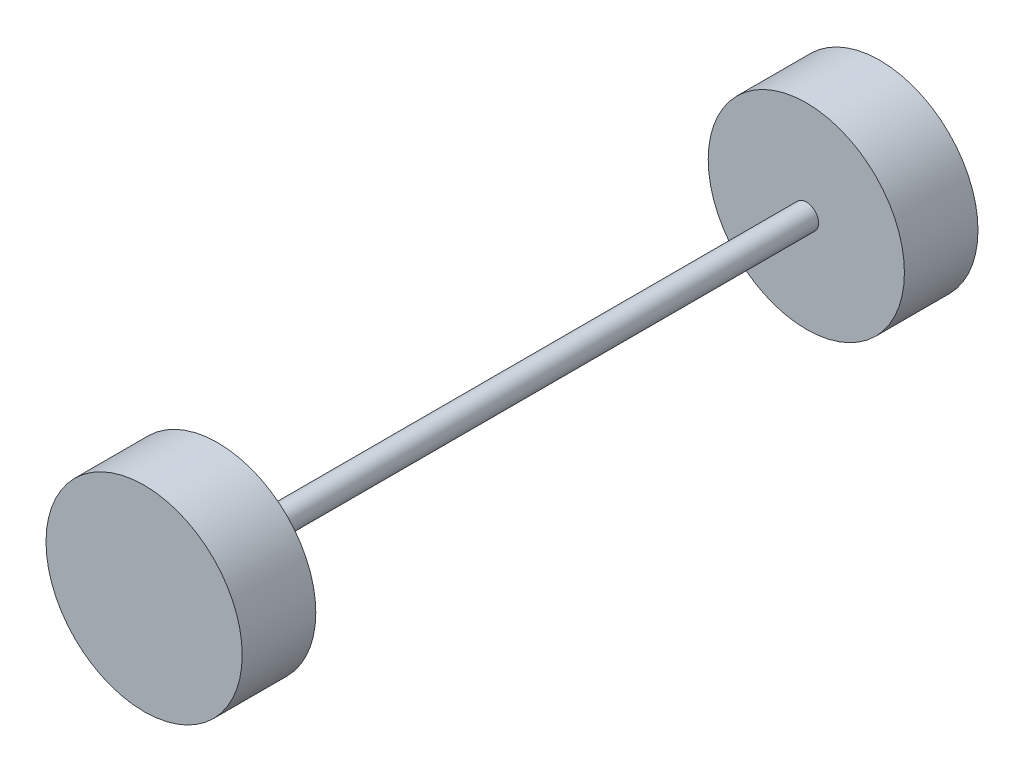
ISO-10303-21;
HEADER;
FILE_DESCRIPTION(('STEP AP214'),'2;1');
FILE_NAME('part.step','',(''),(''),'','','');
FILE_SCHEMA(('AUTOMOTIVE_DESIGN { 1 0 10303 214 1 1 1 1 }'));
ENDSEC;
DATA;
#1=APPLICATION_CONTEXT('core data for automotive mechanical design processes');
#2=APPLICATION_PROTOCOL_DEFINITION('international standard','automotive_design',2000,#1);
#3=PRODUCT_CONTEXT('',#1,'mechanical');
#4=PRODUCT('Part','Part','',(#3));
#5=PRODUCT_RELATED_PRODUCT_CATEGORY('part','',(#4));
#6=PRODUCT_DEFINITION_FORMATION('','',#4);
#7=PRODUCT_DEFINITION_CONTEXT('part definition',#1,'design');
#8=PRODUCT_DEFINITION('design','',#6,#7);
#9=PRODUCT_DEFINITION_SHAPE('','',#8);
#10=(LENGTH_UNIT() NAMED_UNIT(*) SI_UNIT(.MILLI.,.METRE.));
#11=(NAMED_UNIT(*) PLANE_ANGLE_UNIT() SI_UNIT($,.RADIAN.));
#12=(NAMED_UNIT(*) SI_UNIT($,.STERADIAN.) SOLID_ANGLE_UNIT());
#13=UNCERTAINTY_MEASURE_WITH_UNIT(LENGTH_MEASURE(1.E-05),#10,'distance_accuracy_value','');
#14=(GEOMETRIC_REPRESENTATION_CONTEXT(3) GLOBAL_UNCERTAINTY_ASSIGNED_CONTEXT((#13)) GLOBAL_UNIT_ASSIGNED_CONTEXT((#10,
#11,#12)) REPRESENTATION_CONTEXT('',''));
#15=CARTESIAN_POINT('',(0.,0.,0.));
#16=DIRECTION('',(0.,0.,1.));
#17=DIRECTION('',(1.,0.,0.));
#18=AXIS2_PLACEMENT_3D('',#15,#16,#17);
#19=CARTESIAN_POINT('',(0.,0.,76.2));
#20=DIRECTION('',(0.,0.,-1.));
#21=DIRECTION('',(-1.,0.,0.));
#22=AXIS2_PLACEMENT_3D('',#19,#20,#21);
#23=CYLINDRICAL_SURFACE('',#22,101.6);
#24=CARTESIAN_POINT('',(0.,0.,76.2));
#25=DIRECTION('',(0.,0.,1.));
#26=DIRECTION('',(1.,0.,0.));
#27=AXIS2_PLACEMENT_3D('',#24,#25,#26);
#28=CIRCLE('',#27,101.6);
#29=CARTESIAN_POINT('',(101.6,0.,76.2));
#30=VERTEX_POINT('',#29);
#31=EDGE_CURVE('E10',#30,#30,#28,.T.);
#32=ORIENTED_EDGE('',*,*,#31,.F.);
#33=EDGE_LOOP('',(#32));
#34=FACE_BOUND('',#33,.T.);
#35=CARTESIAN_POINT('',(0.,0.,0.));
#36=DIRECTION('',(0.,0.,1.));
#37=DIRECTION('',(1.,0.,0.));
#38=AXIS2_PLACEMENT_3D('',#35,#36,#37);
#39=CIRCLE('',#38,101.6);
#40=CARTESIAN_POINT('',(101.6,0.,0.));
#41=VERTEX_POINT('',#40);
#42=EDGE_CURVE('E38',#41,#41,#39,.T.);
#43=ORIENTED_EDGE('',*,*,#42,.T.);
#44=EDGE_LOOP('',(#43));
#45=FACE_BOUND('',#44,.T.);
#46=ADVANCED_FACE('F35',(#34,#45),#23,.T.);
#47=CARTESIAN_POINT('',(0.,0.,76.2));
#48=DIRECTION('',(0.,0.,1.));
#49=DIRECTION('',(1.,0.,0.));
#50=AXIS2_PLACEMENT_3D('',#47,#48,#49);
#51=PLANE('',#50);
#52=CARTESIAN_POINT('',(0.,0.,76.2));
#53=DIRECTION('',(0.,0.,1.));
#54=DIRECTION('',(1.,0.,0.));
#55=AXIS2_PLACEMENT_3D('',#52,#53,#54);
#56=CIRCLE('',#55,12.7);
#57=CARTESIAN_POINT('',(12.7,0.,76.2));
#58=VERTEX_POINT('',#57);
#59=EDGE_CURVE('E47',#58,#58,#56,.T.);
#60=ORIENTED_EDGE('',*,*,#59,.F.);
#61=EDGE_LOOP('',(#60));
#62=FACE_BOUND('',#61,.T.);
#63=ORIENTED_EDGE('',*,*,#31,.T.);
#64=EDGE_LOOP('',(#63));
#65=FACE_BOUND('',#64,.T.);
#66=ADVANCED_FACE('F76',(#62,#65),#51,.T.);
#67=CARTESIAN_POINT('',(0.,0.,0.));
#68=DIRECTION('',(0.,0.,1.));
#69=DIRECTION('',(1.,0.,0.));
#70=AXIS2_PLACEMENT_3D('',#67,#68,#69);
#71=PLANE('',#70);
#72=ORIENTED_EDGE('',*,*,#42,.F.);
#73=EDGE_LOOP('',(#72));
#74=FACE_BOUND('',#73,.T.);
#75=ADVANCED_FACE('F81',(#74),#71,.F.);
#76=CARTESIAN_POINT('',(0.,0.,685.8));
#77=DIRECTION('',(0.,0.,-1.));
#78=DIRECTION('',(-1.,0.,0.));
#79=AXIS2_PLACEMENT_3D('',#76,#77,#78);
#80=CYLINDRICAL_SURFACE('',#79,12.7);
#81=CARTESIAN_POINT('',(0.,0.,685.8));
#82=DIRECTION('',(0.,0.,1.));
#83=DIRECTION('',(1.,0.,0.));
#84=AXIS2_PLACEMENT_3D('',#81,#82,#83);
#85=CIRCLE('',#84,12.7);
#86=CARTESIAN_POINT('',(12.7,0.,685.8));
#87=VERTEX_POINT('',#86);
#88=EDGE_CURVE('E45',#87,#87,#85,.T.);
#89=ORIENTED_EDGE('',*,*,#88,.F.);
#90=EDGE_LOOP('',(#89));
#91=FACE_BOUND('',#90,.T.);
#92=ORIENTED_EDGE('',*,*,#59,.T.);
#93=EDGE_LOOP('',(#92));
#94=FACE_BOUND('',#93,.T.);
#95=ADVANCED_FACE('F73',(#91,#94),#80,.T.);
#96=CARTESIAN_POINT('',(0.,0.,685.8));
#97=DIRECTION('',(0.,0.,1.));
#98=DIRECTION('',(1.,0.,0.));
#99=AXIS2_PLACEMENT_3D('',#96,#97,#98);
#100=CYLINDRICAL_SURFACE('',#99,101.6);
#101=CARTESIAN_POINT('',(0.,0.,685.8));
#102=DIRECTION('',(0.,0.,1.));
#103=DIRECTION('',(1.,0.,0.));
#104=AXIS2_PLACEMENT_3D('',#101,#102,#103);
#105=CIRCLE('',#104,101.6);
#106=CARTESIAN_POINT('',(101.6,0.,685.8));
#107=VERTEX_POINT('',#106);
#108=EDGE_CURVE('E50',#107,#107,#105,.T.);
#109=ORIENTED_EDGE('',*,*,#108,.T.);
#110=EDGE_LOOP('',(#109));
#111=FACE_BOUND('',#110,.T.);
#112=CARTESIAN_POINT('',(0.,0.,762.));
#113=DIRECTION('',(0.,0.,1.));
#114=DIRECTION('',(1.,0.,0.));
#115=AXIS2_PLACEMENT_3D('',#112,#113,#114);
#116=CIRCLE('',#115,101.6);
#117=CARTESIAN_POINT('',(101.6,0.,762.));
#118=VERTEX_POINT('',#117);
#119=EDGE_CURVE('E53',#118,#118,#116,.T.);
#120=ORIENTED_EDGE('',*,*,#119,.F.);
#121=EDGE_LOOP('',(#120));
#122=FACE_BOUND('',#121,.T.);
#123=ADVANCED_FACE('F59',(#111,#122),#100,.T.);
#124=CARTESIAN_POINT('',(0.,0.,685.8));
#125=DIRECTION('',(0.,0.,-1.));
#126=DIRECTION('',(1.,0.,0.));
#127=AXIS2_PLACEMENT_3D('',#124,#125,#126);
#128=PLANE('',#127);
#129=ORIENTED_EDGE('',*,*,#88,.T.);
#130=EDGE_LOOP('',(#129));
#131=FACE_BOUND('',#130,.T.);
#132=ORIENTED_EDGE('',*,*,#108,.F.);
#133=EDGE_LOOP('',(#132));
#134=FACE_BOUND('',#133,.T.);
#135=ADVANCED_FACE('F62',(#131,#134),#128,.T.);
#136=CARTESIAN_POINT('',(0.,0.,762.));
#137=DIRECTION('',(0.,0.,-1.));
#138=DIRECTION('',(1.,0.,0.));
#139=AXIS2_PLACEMENT_3D('',#136,#137,#138);
#140=PLANE('',#139);
#141=ORIENTED_EDGE('',*,*,#119,.T.);
#142=EDGE_LOOP('',(#141));
#143=FACE_BOUND('',#142,.T.);
#144=ADVANCED_FACE('F64',(#143),#140,.F.);
#145=CLOSED_SHELL('',(#46,#66,#75,#95,#123,#135,#144));
#146=MANIFOLD_SOLID_BREP('B2',#145);
#147=ADVANCED_BREP_SHAPE_REPRESENTATION('',(#18,#146),#14);
#148=SHAPE_DEFINITION_REPRESENTATION(#9,#147);
ENDSEC;
END-ISO-10303-21;
